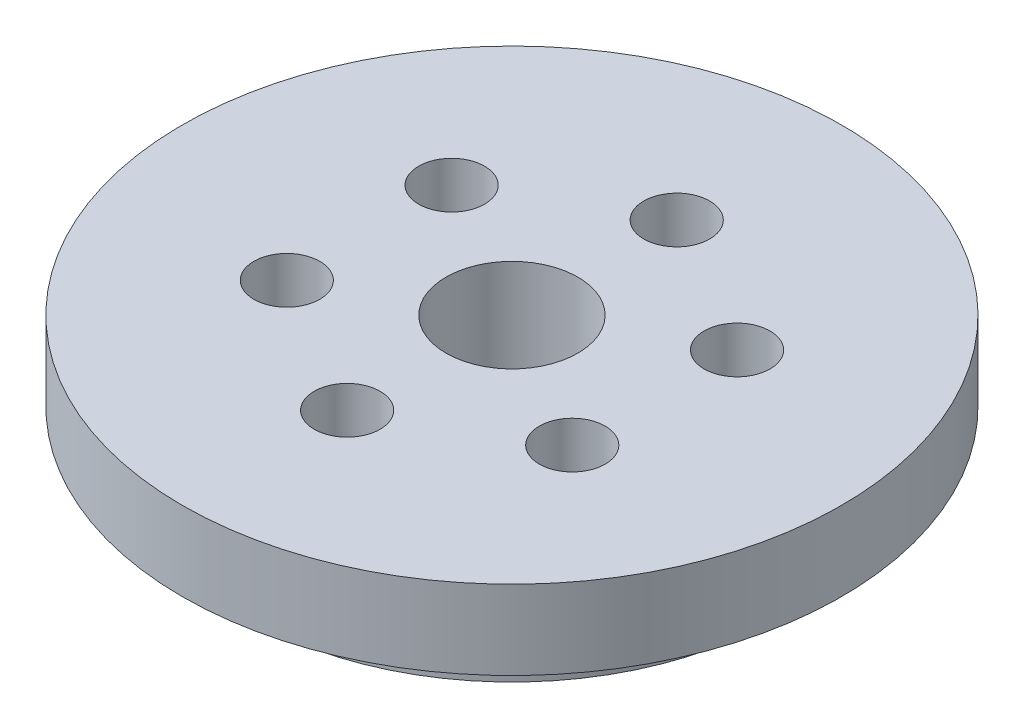
ISO-10303-21;
HEADER;
FILE_DESCRIPTION(('STEP AP214'),'2;1');
FILE_NAME('part.step','',(''),(''),'','','');
FILE_SCHEMA(('AUTOMOTIVE_DESIGN { 1 0 10303 214 1 1 1 1 }'));
ENDSEC;
DATA;
#1=APPLICATION_CONTEXT('core data for automotive mechanical design processes');
#2=APPLICATION_PROTOCOL_DEFINITION('international standard','automotive_design',2000,#1);
#3=PRODUCT_CONTEXT('',#1,'mechanical');
#4=PRODUCT('Part','Part','',(#3));
#5=PRODUCT_RELATED_PRODUCT_CATEGORY('part','',(#4));
#6=PRODUCT_DEFINITION_FORMATION('','',#4);
#7=PRODUCT_DEFINITION_CONTEXT('part definition',#1,'design');
#8=PRODUCT_DEFINITION('design','',#6,#7);
#9=PRODUCT_DEFINITION_SHAPE('','',#8);
#10=(LENGTH_UNIT() NAMED_UNIT(*) SI_UNIT(.MILLI.,.METRE.));
#11=(NAMED_UNIT(*) PLANE_ANGLE_UNIT() SI_UNIT($,.RADIAN.));
#12=(NAMED_UNIT(*) SI_UNIT($,.STERADIAN.) SOLID_ANGLE_UNIT());
#13=UNCERTAINTY_MEASURE_WITH_UNIT(LENGTH_MEASURE(1.E-05),#10,'distance_accuracy_value','');
#14=(GEOMETRIC_REPRESENTATION_CONTEXT(3) GLOBAL_UNCERTAINTY_ASSIGNED_CONTEXT((#13)) GLOBAL_UNIT_ASSIGNED_CONTEXT((#10,
#11,#12)) REPRESENTATION_CONTEXT('',''));
#15=CARTESIAN_POINT('',(0.,0.,0.));
#16=DIRECTION('',(0.,0.,1.));
#17=DIRECTION('',(1.,0.,0.));
#18=AXIS2_PLACEMENT_3D('',#15,#16,#17);
#19=CARTESIAN_POINT('',(0.,0.,0.));
#20=DIRECTION('',(0.,1.,0.));
#21=DIRECTION('',(0.,0.,1.));
#22=AXIS2_PLACEMENT_3D('',#19,#20,#21);
#23=PLANE('',#22);
#24=CARTESIAN_POINT('',(0.,0.,0.));
#25=DIRECTION('',(0.,1.,0.));
#26=DIRECTION('',(0.,0.,1.));
#27=AXIS2_PLACEMENT_3D('',#24,#25,#26);
#28=CIRCLE('',#27,19.95);
#29=CARTESIAN_POINT('',(0.,0.,19.95));
#30=VERTEX_POINT('',#29);
#31=EDGE_CURVE('E40',#30,#30,#28,.T.);
#32=ORIENTED_EDGE('',*,*,#31,.F.);
#33=EDGE_LOOP('',(#32));
#34=FACE_BOUND('',#33,.T.);
#35=CARTESIAN_POINT('',(0.,0.,0.));
#36=DIRECTION('',(0.,1.,0.));
#37=DIRECTION('',(0.,0.,1.));
#38=AXIS2_PLACEMENT_3D('',#35,#36,#37);
#39=CIRCLE('',#38,5.);
#40=CARTESIAN_POINT('',(0.,0.,5.));
#41=VERTEX_POINT('',#40);
#42=EDGE_CURVE('E49',#41,#41,#39,.T.);
#43=ORIENTED_EDGE('',*,*,#42,.T.);
#44=EDGE_LOOP('',(#43));
#45=FACE_BOUND('',#44,.T.);
#46=CARTESIAN_POINT('',(0.,0.,-12.5));
#47=DIRECTION('',(0.,1.,0.));
#48=DIRECTION('',(0.,0.,1.));
#49=AXIS2_PLACEMENT_3D('',#46,#47,#48);
#50=CIRCLE('',#49,2.5);
#51=CARTESIAN_POINT('',(0.,0.,-10.));
#52=VERTEX_POINT('',#51);
#53=EDGE_CURVE('E54',#52,#52,#50,.T.);
#54=ORIENTED_EDGE('',*,*,#53,.T.);
#55=EDGE_LOOP('',(#54));
#56=FACE_BOUND('',#55,.T.);
#57=CARTESIAN_POINT('',(10.8253175473058,0.,-6.25000000000062));
#58=DIRECTION('',(0.,1.,0.));
#59=DIRECTION('',(0.,0.,1.));
#60=AXIS2_PLACEMENT_3D('',#57,#58,#59);
#61=CIRCLE('',#60,2.5);
#62=CARTESIAN_POINT('',(10.8253175473058,0.,-3.75000000000062));
#63=VERTEX_POINT('',#62);
#64=EDGE_CURVE('E58',#63,#63,#61,.T.);
#65=ORIENTED_EDGE('',*,*,#64,.T.);
#66=EDGE_LOOP('',(#65));
#67=FACE_BOUND('',#66,.T.);
#68=CARTESIAN_POINT('',(10.8253175473065,0.,6.24999999999939));
#69=DIRECTION('',(0.,1.,0.));
#70=DIRECTION('',(0.,0.,1.));
#71=AXIS2_PLACEMENT_3D('',#68,#69,#70);
#72=CIRCLE('',#71,2.5);
#73=CARTESIAN_POINT('',(10.8253175473065,0.,8.74999999999939));
#74=VERTEX_POINT('',#73);
#75=EDGE_CURVE('E62',#74,#74,#72,.T.);
#76=ORIENTED_EDGE('',*,*,#75,.T.);
#77=EDGE_LOOP('',(#76));
#78=FACE_BOUND('',#77,.T.);
#79=CARTESIAN_POINT('',(1.4164930460234E-12,0.,12.5));
#80=DIRECTION('',(0.,1.,0.));
#81=DIRECTION('',(0.,0.,1.));
#82=AXIS2_PLACEMENT_3D('',#79,#80,#81);
#83=CIRCLE('',#82,2.5);
#84=CARTESIAN_POINT('',(1.4164930460234E-12,0.,15.));
#85=VERTEX_POINT('',#84);
#86=EDGE_CURVE('E66',#85,#85,#83,.T.);
#87=ORIENTED_EDGE('',*,*,#86,.T.);
#88=EDGE_LOOP('',(#87));
#89=FACE_BOUND('',#88,.T.);
#90=CARTESIAN_POINT('',(-10.8253175473044,0.,6.25000000000062));
#91=DIRECTION('',(0.,1.,0.));
#92=DIRECTION('',(0.,0.,1.));
#93=AXIS2_PLACEMENT_3D('',#90,#91,#92);
#94=CIRCLE('',#93,2.5);
#95=CARTESIAN_POINT('',(-10.8253175473044,0.,8.75000000000062));
#96=VERTEX_POINT('',#95);
#97=EDGE_CURVE('E70',#96,#96,#94,.T.);
#98=ORIENTED_EDGE('',*,*,#97,.T.);
#99=EDGE_LOOP('',(#98));
#100=FACE_BOUND('',#99,.T.);
#101=CARTESIAN_POINT('',(-10.8253175473051,0.,-6.24999999999938));
#102=DIRECTION('',(0.,1.,0.));
#103=DIRECTION('',(0.,0.,1.));
#104=AXIS2_PLACEMENT_3D('',#101,#102,#103);
#105=CIRCLE('',#104,2.5);
#106=CARTESIAN_POINT('',(-10.8253175473051,0.,-3.74999999999938));
#107=VERTEX_POINT('',#106);
#108=EDGE_CURVE('E74',#107,#107,#105,.T.);
#109=ORIENTED_EDGE('',*,*,#108,.T.);
#110=EDGE_LOOP('',(#109));
#111=FACE_BOUND('',#110,.T.);
#112=ADVANCED_FACE('F36',(#34,#45,#56,#67,#78,#89,#100,#111),#23,.F.);
#113=CARTESIAN_POINT('',(0.,4.,0.));
#114=DIRECTION('',(0.,-1.,0.));
#115=DIRECTION('',(0.,0.,-1.));
#116=AXIS2_PLACEMENT_3D('',#113,#114,#115);
#117=CYLINDRICAL_SURFACE('',#116,19.95);
#118=CARTESIAN_POINT('',(0.,4.,0.));
#119=DIRECTION('',(0.,1.,0.));
#120=DIRECTION('',(0.,0.,1.));
#121=AXIS2_PLACEMENT_3D('',#118,#119,#120);
#122=CIRCLE('',#121,19.95);
#123=CARTESIAN_POINT('',(0.,4.,19.95));
#124=VERTEX_POINT('',#123);
#125=EDGE_CURVE('E10',#124,#124,#122,.T.);
#126=ORIENTED_EDGE('',*,*,#125,.F.);
#127=EDGE_LOOP('',(#126));
#128=FACE_BOUND('',#127,.T.);
#129=ORIENTED_EDGE('',*,*,#31,.T.);
#130=EDGE_LOOP('',(#129));
#131=FACE_BOUND('',#130,.T.);
#132=ADVANCED_FACE('F38',(#128,#131),#117,.T.);
#133=CARTESIAN_POINT('',(0.,4.,0.));
#134=DIRECTION('',(0.,-1.,0.));
#135=DIRECTION('',(0.,0.,-1.));
#136=AXIS2_PLACEMENT_3D('',#133,#134,#135);
#137=CYLINDRICAL_SURFACE('',#136,5.);
#138=ORIENTED_EDGE('',*,*,#42,.F.);
#139=EDGE_LOOP('',(#138));
#140=FACE_BOUND('',#139,.T.);
#141=CARTESIAN_POINT('',(0.,10.,0.));
#142=DIRECTION('',(0.,1.,0.));
#143=DIRECTION('',(0.,0.,1.));
#144=AXIS2_PLACEMENT_3D('',#141,#142,#143);
#145=CIRCLE('',#144,5.);
#146=CARTESIAN_POINT('',(0.,10.,5.));
#147=VERTEX_POINT('',#146);
#148=EDGE_CURVE('E98',#147,#147,#145,.T.);
#149=ORIENTED_EDGE('',*,*,#148,.T.);
#150=EDGE_LOOP('',(#149));
#151=FACE_BOUND('',#150,.T.);
#152=ADVANCED_FACE('F138',(#140,#151),#137,.F.);
#153=CARTESIAN_POINT('',(0.,4.,-12.5));
#154=DIRECTION('',(0.,-1.,0.));
#155=DIRECTION('',(0.,0.,-1.));
#156=AXIS2_PLACEMENT_3D('',#153,#154,#155);
#157=CYLINDRICAL_SURFACE('',#156,2.5);
#158=ORIENTED_EDGE('',*,*,#53,.F.);
#159=EDGE_LOOP('',(#158));
#160=FACE_BOUND('',#159,.T.);
#161=CARTESIAN_POINT('',(0.,10.,-12.5));
#162=DIRECTION('',(0.,1.,0.));
#163=DIRECTION('',(0.,0.,1.));
#164=AXIS2_PLACEMENT_3D('',#161,#162,#163);
#165=CIRCLE('',#164,2.5);
#166=CARTESIAN_POINT('',(0.,10.,-10.));
#167=VERTEX_POINT('',#166);
#168=EDGE_CURVE('E83',#167,#167,#165,.T.);
#169=ORIENTED_EDGE('',*,*,#168,.T.);
#170=EDGE_LOOP('',(#169));
#171=FACE_BOUND('',#170,.T.);
#172=ADVANCED_FACE('F145',(#160,#171),#157,.F.);
#173=CARTESIAN_POINT('',(10.8253175473058,4.,-6.25000000000062));
#174=DIRECTION('',(0.,-1.,0.));
#175=DIRECTION('',(0.,0.,-1.));
#176=AXIS2_PLACEMENT_3D('',#173,#174,#175);
#177=CYLINDRICAL_SURFACE('',#176,2.5);
#178=ORIENTED_EDGE('',*,*,#64,.F.);
#179=EDGE_LOOP('',(#178));
#180=FACE_BOUND('',#179,.T.);
#181=CARTESIAN_POINT('',(10.8253175473058,10.,-6.25000000000062));
#182=DIRECTION('',(0.,1.,0.));
#183=DIRECTION('',(0.,0.,1.));
#184=AXIS2_PLACEMENT_3D('',#181,#182,#183);
#185=CIRCLE('',#184,2.5);
#186=CARTESIAN_POINT('',(10.8253175473058,10.,-3.75000000000062));
#187=VERTEX_POINT('',#186);
#188=EDGE_CURVE('E90',#187,#187,#185,.T.);
#189=ORIENTED_EDGE('',*,*,#188,.T.);
#190=EDGE_LOOP('',(#189));
#191=FACE_BOUND('',#190,.T.);
#192=ADVANCED_FACE('F149',(#180,#191),#177,.F.);
#193=CARTESIAN_POINT('',(10.8253175473065,4.,6.24999999999939));
#194=DIRECTION('',(0.,-1.,0.));
#195=DIRECTION('',(0.,0.,-1.));
#196=AXIS2_PLACEMENT_3D('',#193,#194,#195);
#197=CYLINDRICAL_SURFACE('',#196,2.5);
#198=ORIENTED_EDGE('',*,*,#75,.F.);
#199=EDGE_LOOP('',(#198));
#200=FACE_BOUND('',#199,.T.);
#201=CARTESIAN_POINT('',(10.8253175473065,10.,6.24999999999939));
#202=DIRECTION('',(0.,1.,0.));
#203=DIRECTION('',(0.,0.,1.));
#204=AXIS2_PLACEMENT_3D('',#201,#202,#203);
#205=CIRCLE('',#204,2.5);
#206=CARTESIAN_POINT('',(10.8253175473065,10.,8.74999999999939));
#207=VERTEX_POINT('',#206);
#208=EDGE_CURVE('E94',#207,#207,#205,.T.);
#209=ORIENTED_EDGE('',*,*,#208,.T.);
#210=EDGE_LOOP('',(#209));
#211=FACE_BOUND('',#210,.T.);
#212=ADVANCED_FACE('F153',(#200,#211),#197,.F.);
#213=CARTESIAN_POINT('',(1.4164930460234E-12,4.,12.5));
#214=DIRECTION('',(0.,-1.,0.));
#215=DIRECTION('',(0.,0.,-1.));
#216=AXIS2_PLACEMENT_3D('',#213,#214,#215);
#217=CYLINDRICAL_SURFACE('',#216,2.5);
#218=ORIENTED_EDGE('',*,*,#86,.F.);
#219=EDGE_LOOP('',(#218));
#220=FACE_BOUND('',#219,.T.);
#221=CARTESIAN_POINT('',(1.4164930460234E-12,10.,12.5));
#222=DIRECTION('',(0.,1.,0.));
#223=DIRECTION('',(0.,0.,1.));
#224=AXIS2_PLACEMENT_3D('',#221,#222,#223);
#225=CIRCLE('',#224,2.5);
#226=CARTESIAN_POINT('',(1.4164930460234E-12,10.,15.));
#227=VERTEX_POINT('',#226);
#228=EDGE_CURVE('E102',#227,#227,#225,.T.);
#229=ORIENTED_EDGE('',*,*,#228,.T.);
#230=EDGE_LOOP('',(#229));
#231=FACE_BOUND('',#230,.T.);
#232=ADVANCED_FACE('F157',(#220,#231),#217,.F.);
#233=CARTESIAN_POINT('',(-10.8253175473044,4.,6.25000000000062));
#234=DIRECTION('',(0.,-1.,0.));
#235=DIRECTION('',(0.,0.,-1.));
#236=AXIS2_PLACEMENT_3D('',#233,#234,#235);
#237=CYLINDRICAL_SURFACE('',#236,2.5);
#238=ORIENTED_EDGE('',*,*,#97,.F.);
#239=EDGE_LOOP('',(#238));
#240=FACE_BOUND('',#239,.T.);
#241=CARTESIAN_POINT('',(-10.8253175473044,10.,6.25000000000062));
#242=DIRECTION('',(0.,1.,0.));
#243=DIRECTION('',(0.,0.,1.));
#244=AXIS2_PLACEMENT_3D('',#241,#242,#243);
#245=CIRCLE('',#244,2.5);
#246=CARTESIAN_POINT('',(-10.8253175473044,10.,8.75000000000062));
#247=VERTEX_POINT('',#246);
#248=EDGE_CURVE('E106',#247,#247,#245,.T.);
#249=ORIENTED_EDGE('',*,*,#248,.T.);
#250=EDGE_LOOP('',(#249));
#251=FACE_BOUND('',#250,.T.);
#252=ADVANCED_FACE('F128',(#240,#251),#237,.F.);
#253=CARTESIAN_POINT('',(-10.8253175473051,4.,-6.24999999999938));
#254=DIRECTION('',(0.,-1.,0.));
#255=DIRECTION('',(0.,0.,-1.));
#256=AXIS2_PLACEMENT_3D('',#253,#254,#255);
#257=CYLINDRICAL_SURFACE('',#256,2.5);
#258=ORIENTED_EDGE('',*,*,#108,.F.);
#259=EDGE_LOOP('',(#258));
#260=FACE_BOUND('',#259,.T.);
#261=CARTESIAN_POINT('',(-10.8253175473051,10.,-6.24999999999938));
#262=DIRECTION('',(0.,1.,0.));
#263=DIRECTION('',(0.,0.,1.));
#264=AXIS2_PLACEMENT_3D('',#261,#262,#263);
#265=CIRCLE('',#264,2.5);
#266=CARTESIAN_POINT('',(-10.8253175473051,10.,-3.74999999999938));
#267=VERTEX_POINT('',#266);
#268=EDGE_CURVE('E110',#267,#267,#265,.T.);
#269=ORIENTED_EDGE('',*,*,#268,.T.);
#270=EDGE_LOOP('',(#269));
#271=FACE_BOUND('',#270,.T.);
#272=ADVANCED_FACE('F115',(#260,#271),#257,.F.);
#273=CARTESIAN_POINT('',(0.,10.,0.));
#274=DIRECTION('',(0.,1.,0.));
#275=DIRECTION('',(0.,0.,1.));
#276=AXIS2_PLACEMENT_3D('',#273,#274,#275);
#277=PLANE('',#276);
#278=ORIENTED_EDGE('',*,*,#248,.F.);
#279=EDGE_LOOP('',(#278));
#280=FACE_BOUND('',#279,.T.);
#281=ORIENTED_EDGE('',*,*,#148,.F.);
#282=EDGE_LOOP('',(#281));
#283=FACE_BOUND('',#282,.T.);
#284=ORIENTED_EDGE('',*,*,#188,.F.);
#285=EDGE_LOOP('',(#284));
#286=FACE_BOUND('',#285,.T.);
#287=CARTESIAN_POINT('',(0.,10.,0.));
#288=DIRECTION('',(0.,1.,0.));
#289=DIRECTION('',(0.,0.,1.));
#290=AXIS2_PLACEMENT_3D('',#287,#288,#289);
#291=CIRCLE('',#290,25.);
#292=CARTESIAN_POINT('',(0.,10.,25.));
#293=VERTEX_POINT('',#292);
#294=EDGE_CURVE('E78',#293,#293,#291,.T.);
#295=ORIENTED_EDGE('',*,*,#294,.T.);
#296=EDGE_LOOP('',(#295));
#297=FACE_BOUND('',#296,.T.);
#298=ORIENTED_EDGE('',*,*,#168,.F.);
#299=EDGE_LOOP('',(#298));
#300=FACE_BOUND('',#299,.T.);
#301=ORIENTED_EDGE('',*,*,#208,.F.);
#302=EDGE_LOOP('',(#301));
#303=FACE_BOUND('',#302,.T.);
#304=ORIENTED_EDGE('',*,*,#228,.F.);
#305=EDGE_LOOP('',(#304));
#306=FACE_BOUND('',#305,.T.);
#307=ORIENTED_EDGE('',*,*,#268,.F.);
#308=EDGE_LOOP('',(#307));
#309=FACE_BOUND('',#308,.T.);
#310=ADVANCED_FACE('F117',(#280,#283,#286,#297,#300,#303,#306,#309),#277,.T.);
#311=CARTESIAN_POINT('',(0.,4.,0.));
#312=DIRECTION('',(0.,1.,0.));
#313=DIRECTION('',(0.,0.,1.));
#314=AXIS2_PLACEMENT_3D('',#311,#312,#313);
#315=PLANE('',#314);
#316=ORIENTED_EDGE('',*,*,#125,.T.);
#317=EDGE_LOOP('',(#316));
#318=FACE_BOUND('',#317,.T.);
#319=CARTESIAN_POINT('',(0.,4.,0.));
#320=DIRECTION('',(0.,1.,0.));
#321=DIRECTION('',(0.,0.,1.));
#322=AXIS2_PLACEMENT_3D('',#319,#320,#321);
#323=CIRCLE('',#322,25.);
#324=CARTESIAN_POINT('',(0.,4.,25.));
#325=VERTEX_POINT('',#324);
#326=EDGE_CURVE('E79',#325,#325,#323,.T.);
#327=ORIENTED_EDGE('',*,*,#326,.F.);
#328=EDGE_LOOP('',(#327));
#329=FACE_BOUND('',#328,.T.);
#330=ADVANCED_FACE('F119',(#318,#329),#315,.F.);
#331=CARTESIAN_POINT('',(0.,10.,0.));
#332=DIRECTION('',(0.,-1.,0.));
#333=DIRECTION('',(0.,0.,-1.));
#334=AXIS2_PLACEMENT_3D('',#331,#332,#333);
#335=CYLINDRICAL_SURFACE('',#334,25.);
#336=ORIENTED_EDGE('',*,*,#294,.F.);
#337=EDGE_LOOP('',(#336));
#338=FACE_BOUND('',#337,.T.);
#339=ORIENTED_EDGE('',*,*,#326,.T.);
#340=EDGE_LOOP('',(#339));
#341=FACE_BOUND('',#340,.T.);
#342=ADVANCED_FACE('F126',(#338,#341),#335,.T.);
#343=CLOSED_SHELL('',(#112,#132,#152,#172,#192,#212,#232,#252,#272,#310,#330,#342));
#344=MANIFOLD_SOLID_BREP('B2',#343);
#345=ADVANCED_BREP_SHAPE_REPRESENTATION('',(#18,#344),#14);
#346=SHAPE_DEFINITION_REPRESENTATION(#9,#345);
ENDSEC;
END-ISO-10303-21;
